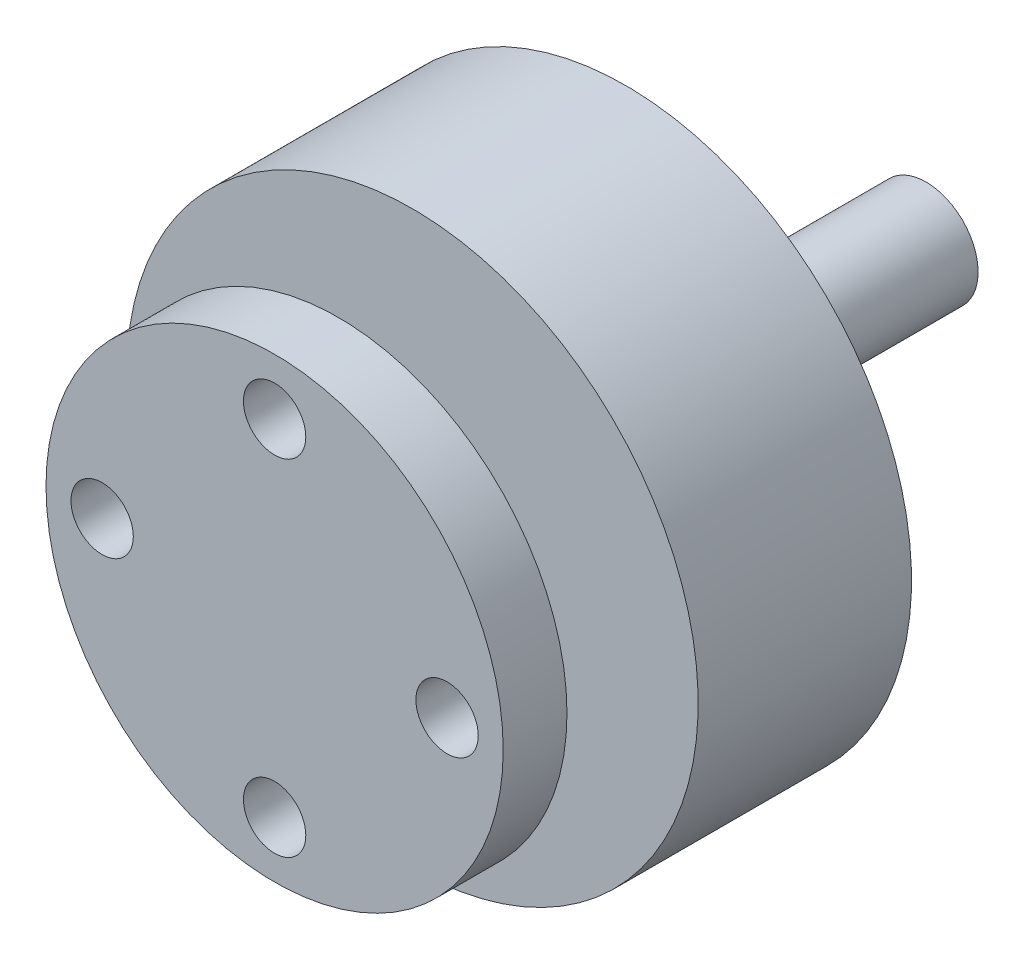
ISO-10303-21;
HEADER;
FILE_DESCRIPTION(('STEP AP214'),'2;1');
FILE_NAME('part.step','',(''),(''),'','','');
FILE_SCHEMA(('AUTOMOTIVE_DESIGN { 1 0 10303 214 1 1 1 1 }'));
ENDSEC;
DATA;
#1=APPLICATION_CONTEXT('core data for automotive mechanical design processes');
#2=APPLICATION_PROTOCOL_DEFINITION('international standard','automotive_design',2000,#1);
#3=PRODUCT_CONTEXT('',#1,'mechanical');
#4=PRODUCT('Part','Part','',(#3));
#5=PRODUCT_RELATED_PRODUCT_CATEGORY('part','',(#4));
#6=PRODUCT_DEFINITION_FORMATION('','',#4);
#7=PRODUCT_DEFINITION_CONTEXT('part definition',#1,'design');
#8=PRODUCT_DEFINITION('design','',#6,#7);
#9=PRODUCT_DEFINITION_SHAPE('','',#8);
#10=(LENGTH_UNIT() NAMED_UNIT(*) SI_UNIT(.MILLI.,.METRE.));
#11=(NAMED_UNIT(*) PLANE_ANGLE_UNIT() SI_UNIT($,.RADIAN.));
#12=(NAMED_UNIT(*) SI_UNIT($,.STERADIAN.) SOLID_ANGLE_UNIT());
#13=UNCERTAINTY_MEASURE_WITH_UNIT(LENGTH_MEASURE(1.E-05),#10,'distance_accuracy_value','');
#14=(GEOMETRIC_REPRESENTATION_CONTEXT(3) GLOBAL_UNCERTAINTY_ASSIGNED_CONTEXT((#13)) GLOBAL_UNIT_ASSIGNED_CONTEXT((#10,
#11,#12)) REPRESENTATION_CONTEXT('',''));
#15=CARTESIAN_POINT('',(0.,0.,0.));
#16=DIRECTION('',(0.,0.,1.));
#17=DIRECTION('',(1.,0.,0.));
#18=AXIS2_PLACEMENT_3D('',#15,#16,#17);
#19=CARTESIAN_POINT('',(0.,0.,0.));
#20=DIRECTION('',(0.,0.,-1.));
#21=DIRECTION('',(-1.,0.,0.));
#22=AXIS2_PLACEMENT_3D('',#19,#20,#21);
#23=PLANE('',#22);
#24=CARTESIAN_POINT('',(8.2988893822453,0.,0.));
#25=DIRECTION('',(0.,0.,1.));
#26=DIRECTION('',(1.,0.,0.));
#27=AXIS2_PLACEMENT_3D('',#24,#25,#26);
#28=CIRCLE('',#27,1.5);
#29=CARTESIAN_POINT('',(9.7988893822453,0.,0.));
#30=VERTEX_POINT('',#29);
#31=EDGE_CURVE('E62',#30,#30,#28,.T.);
#32=ORIENTED_EDGE('',*,*,#31,.F.);
#33=EDGE_LOOP('',(#32));
#34=FACE_BOUND('',#33,.T.);
#35=CARTESIAN_POINT('',(0.,-8.2988893822453,0.));
#36=DIRECTION('',(0.,0.,1.));
#37=DIRECTION('',(1.,0.,0.));
#38=AXIS2_PLACEMENT_3D('',#35,#36,#37);
#39=CIRCLE('',#38,1.5);
#40=CARTESIAN_POINT('',(1.49999999999997,-8.2988893822453,0.));
#41=VERTEX_POINT('',#40);
#42=EDGE_CURVE('E169',#41,#41,#39,.T.);
#43=ORIENTED_EDGE('',*,*,#42,.F.);
#44=EDGE_LOOP('',(#43));
#45=FACE_BOUND('',#44,.T.);
#46=CARTESIAN_POINT('',(-8.2988893822453,0.,0.));
#47=DIRECTION('',(0.,0.,1.));
#48=DIRECTION('',(1.,0.,0.));
#49=AXIS2_PLACEMENT_3D('',#46,#47,#48);
#50=CIRCLE('',#49,1.5);
#51=CARTESIAN_POINT('',(-6.7988893822453,0.,0.));
#52=VERTEX_POINT('',#51);
#53=EDGE_CURVE('E173',#52,#52,#50,.T.);
#54=ORIENTED_EDGE('',*,*,#53,.F.);
#55=EDGE_LOOP('',(#54));
#56=FACE_BOUND('',#55,.T.);
#57=CARTESIAN_POINT('',(0.,8.2988893822453,0.));
#58=DIRECTION('',(0.,0.,1.));
#59=DIRECTION('',(1.,0.,0.));
#60=AXIS2_PLACEMENT_3D('',#57,#58,#59);
#61=CIRCLE('',#60,1.5);
#62=CARTESIAN_POINT('',(1.50000000000009,8.2988893822453,0.));
#63=VERTEX_POINT('',#62);
#64=EDGE_CURVE('E86',#63,#63,#61,.T.);
#65=ORIENTED_EDGE('',*,*,#64,.F.);
#66=EDGE_LOOP('',(#65));
#67=FACE_BOUND('',#66,.T.);
#68=CARTESIAN_POINT('',(0.,0.,0.));
#69=DIRECTION('',(0.,0.,-1.));
#70=DIRECTION('',(-1.,0.,0.));
#71=AXIS2_PLACEMENT_3D('',#68,#69,#70);
#72=CIRCLE('',#71,11.);
#73=CARTESIAN_POINT('',(-11.,0.,0.));
#74=VERTEX_POINT('',#73);
#75=EDGE_CURVE('E10',#74,#74,#72,.T.);
#76=ORIENTED_EDGE('',*,*,#75,.F.);
#77=EDGE_LOOP('',(#76));
#78=FACE_BOUND('',#77,.T.);
#79=ADVANCED_FACE('F39',(#34,#45,#56,#67,#78),#23,.F.);
#80=CARTESIAN_POINT('',(0.,0.,-31.35));
#81=DIRECTION('',(0.,0.,-1.));
#82=DIRECTION('',(-1.,0.,0.));
#83=AXIS2_PLACEMENT_3D('',#80,#81,#82);
#84=CYLINDRICAL_SURFACE('',#83,11.);
#85=CARTESIAN_POINT('',(0.,0.,-3.06822982991311));
#86=DIRECTION('',(0.,0.,-1.));
#87=DIRECTION('',(-1.,0.,0.));
#88=AXIS2_PLACEMENT_3D('',#85,#86,#87);
#89=CIRCLE('',#88,11.);
#90=CARTESIAN_POINT('',(-11.,0.,-3.06822982991311));
#91=VERTEX_POINT('',#90);
#92=EDGE_CURVE('E47',#91,#91,#89,.T.);
#93=ORIENTED_EDGE('',*,*,#92,.F.);
#94=EDGE_LOOP('',(#93));
#95=FACE_BOUND('',#94,.T.);
#96=ORIENTED_EDGE('',*,*,#75,.T.);
#97=EDGE_LOOP('',(#96));
#98=FACE_BOUND('',#97,.T.);
#99=ADVANCED_FACE('F112',(#95,#98),#84,.T.);
#100=CARTESIAN_POINT('',(11.,0.,-3.0682298299131));
#101=DIRECTION('',(0.,0.,1.));
#102=DIRECTION('',(1.,0.,0.));
#103=AXIS2_PLACEMENT_3D('',#100,#101,#102);
#104=PLANE('',#103);
#105=CARTESIAN_POINT('',(8.2988893822453,0.,-3.0682298299131));
#106=DIRECTION('',(0.,0.,1.));
#107=DIRECTION('',(1.,0.,0.));
#108=AXIS2_PLACEMENT_3D('',#105,#106,#107);
#109=CIRCLE('',#108,1.5);
#110=CARTESIAN_POINT('',(9.7988893822453,0.,-3.0682298299131));
#111=VERTEX_POINT('',#110);
#112=EDGE_CURVE('E42',#111,#111,#109,.T.);
#113=ORIENTED_EDGE('',*,*,#112,.T.);
#114=EDGE_LOOP('',(#113));
#115=FACE_BOUND('',#114,.T.);
#116=CARTESIAN_POINT('',(0.,-8.2988893822453,-3.0682298299131));
#117=DIRECTION('',(0.,0.,1.));
#118=DIRECTION('',(1.,0.,0.));
#119=AXIS2_PLACEMENT_3D('',#116,#117,#118);
#120=CIRCLE('',#119,1.5);
#121=CARTESIAN_POINT('',(1.49999999999997,-8.2988893822453,-3.0682298299131));
#122=VERTEX_POINT('',#121);
#123=EDGE_CURVE('E65',#122,#122,#120,.T.);
#124=ORIENTED_EDGE('',*,*,#123,.T.);
#125=EDGE_LOOP('',(#124));
#126=FACE_BOUND('',#125,.T.);
#127=CARTESIAN_POINT('',(-8.2988893822453,0.,-3.06822982991311));
#128=DIRECTION('',(0.,0.,1.));
#129=DIRECTION('',(1.,0.,0.));
#130=AXIS2_PLACEMENT_3D('',#127,#128,#129);
#131=CIRCLE('',#130,1.5);
#132=CARTESIAN_POINT('',(-6.7988893822453,0.,-3.06822982991311));
#133=VERTEX_POINT('',#132);
#134=EDGE_CURVE('E61',#133,#133,#131,.T.);
#135=ORIENTED_EDGE('',*,*,#134,.T.);
#136=EDGE_LOOP('',(#135));
#137=FACE_BOUND('',#136,.T.);
#138=CARTESIAN_POINT('',(0.,8.2988893822453,-3.0682298299131));
#139=DIRECTION('',(0.,0.,1.));
#140=DIRECTION('',(1.,0.,0.));
#141=AXIS2_PLACEMENT_3D('',#138,#139,#140);
#142=CIRCLE('',#141,1.5);
#143=CARTESIAN_POINT('',(1.50000000000009,8.2988893822453,-3.0682298299131));
#144=VERTEX_POINT('',#143);
#145=EDGE_CURVE('E57',#144,#144,#142,.T.);
#146=ORIENTED_EDGE('',*,*,#145,.T.);
#147=EDGE_LOOP('',(#146));
#148=FACE_BOUND('',#147,.T.);
#149=CARTESIAN_POINT('',(0.,0.,-3.0682298299131));
#150=DIRECTION('',(0.,0.,-1.));
#151=DIRECTION('',(-1.,0.,0.));
#152=AXIS2_PLACEMENT_3D('',#149,#150,#151);
#153=CIRCLE('',#152,3.7385620799455);
#154=CARTESIAN_POINT('',(-3.73856207994549,0.,-3.0682298299131));
#155=VERTEX_POINT('',#154);
#156=EDGE_CURVE('E53',#155,#155,#153,.T.);
#157=ORIENTED_EDGE('',*,*,#156,.F.);
#158=EDGE_LOOP('',(#157));
#159=FACE_BOUND('',#158,.T.);
#160=ORIENTED_EDGE('',*,*,#92,.T.);
#161=EDGE_LOOP('',(#160));
#162=FACE_BOUND('',#161,.T.);
#163=ADVANCED_FACE('F109',(#115,#126,#137,#148,#159,#162),#104,.F.);
#164=CARTESIAN_POINT('',(0.,0.,-31.35));
#165=DIRECTION('',(0.,0.,-1.));
#166=DIRECTION('',(-1.,0.,0.));
#167=AXIS2_PLACEMENT_3D('',#164,#165,#166);
#168=CYLINDRICAL_SURFACE('',#167,3.73856207994549);
#169=CARTESIAN_POINT('',(0.,0.,-6.6312906854376));
#170=DIRECTION('',(0.,0.,-1.));
#171=DIRECTION('',(-1.,0.,0.));
#172=AXIS2_PLACEMENT_3D('',#169,#170,#171);
#173=CIRCLE('',#172,3.73856207994549);
#174=CARTESIAN_POINT('',(-3.73856207994549,0.,-6.63129068543761));
#175=VERTEX_POINT('',#174);
#176=EDGE_CURVE('E100',#175,#175,#173,.T.);
#177=ORIENTED_EDGE('',*,*,#176,.F.);
#178=EDGE_LOOP('',(#177));
#179=FACE_BOUND('',#178,.T.);
#180=ORIENTED_EDGE('',*,*,#156,.T.);
#181=EDGE_LOOP('',(#180));
#182=FACE_BOUND('',#181,.T.);
#183=ADVANCED_FACE('F107',(#179,#182),#168,.T.);
#184=CARTESIAN_POINT('',(3.7385620799455,0.,-6.63129068543761));
#185=DIRECTION('',(0.,0.,-1.));
#186=DIRECTION('',(-1.,0.,0.));
#187=AXIS2_PLACEMENT_3D('',#184,#185,#186);
#188=PLANE('',#187);
#189=CARTESIAN_POINT('',(0.,0.,-6.63129068543761));
#190=DIRECTION('',(0.,0.,-1.));
#191=DIRECTION('',(-1.,0.,0.));
#192=AXIS2_PLACEMENT_3D('',#189,#190,#191);
#193=CIRCLE('',#192,13.75);
#194=CARTESIAN_POINT('',(-13.75,0.,-6.63129068543761));
#195=VERTEX_POINT('',#194);
#196=EDGE_CURVE('E96',#195,#195,#193,.T.);
#197=ORIENTED_EDGE('',*,*,#196,.F.);
#198=EDGE_LOOP('',(#197));
#199=FACE_BOUND('',#198,.T.);
#200=ORIENTED_EDGE('',*,*,#176,.T.);
#201=EDGE_LOOP('',(#200));
#202=FACE_BOUND('',#201,.T.);
#203=ADVANCED_FACE('F124',(#199,#202),#188,.F.);
#204=CARTESIAN_POINT('',(0.,0.,-31.35));
#205=DIRECTION('',(0.,0.,-1.));
#206=DIRECTION('',(-1.,0.,0.));
#207=AXIS2_PLACEMENT_3D('',#204,#205,#206);
#208=CYLINDRICAL_SURFACE('',#207,13.75);
#209=CARTESIAN_POINT('',(0.,0.,-16.8962993406391));
#210=DIRECTION('',(0.,0.,-1.));
#211=DIRECTION('',(-1.,0.,0.));
#212=AXIS2_PLACEMENT_3D('',#209,#210,#211);
#213=CIRCLE('',#212,13.75);
#214=CARTESIAN_POINT('',(-13.75,0.,-16.8962993406391));
#215=VERTEX_POINT('',#214);
#216=EDGE_CURVE('E92',#215,#215,#213,.T.);
#217=ORIENTED_EDGE('',*,*,#216,.F.);
#218=EDGE_LOOP('',(#217));
#219=FACE_BOUND('',#218,.T.);
#220=ORIENTED_EDGE('',*,*,#196,.T.);
#221=EDGE_LOOP('',(#220));
#222=FACE_BOUND('',#221,.T.);
#223=ADVANCED_FACE('F128',(#219,#222),#208,.T.);
#224=CARTESIAN_POINT('',(0.,0.,-16.8962993406391));
#225=DIRECTION('',(0.,0.,1.));
#226=DIRECTION('',(1.,0.,0.));
#227=AXIS2_PLACEMENT_3D('',#224,#225,#226);
#228=CONICAL_SURFACE('',#227,13.75,1.17848113510543);
#229=CARTESIAN_POINT('',(0.,0.,-19.35));
#230=DIRECTION('',(0.,0.,-1.));
#231=DIRECTION('',(-1.,0.,0.));
#232=AXIS2_PLACEMENT_3D('',#229,#230,#231);
#233=CIRCLE('',#232,7.81980457823857);
#234=CARTESIAN_POINT('',(-7.81980457823857,0.,-19.35));
#235=VERTEX_POINT('',#234);
#236=EDGE_CURVE('E83',#235,#235,#233,.T.);
#237=ORIENTED_EDGE('',*,*,#236,.F.);
#238=EDGE_LOOP('',(#237));
#239=FACE_BOUND('',#238,.T.);
#240=ORIENTED_EDGE('',*,*,#216,.T.);
#241=EDGE_LOOP('',(#240));
#242=FACE_BOUND('',#241,.T.);
#243=ADVANCED_FACE('F132',(#239,#242),#228,.T.);
#244=CARTESIAN_POINT('',(7.81980457823857,0.,-19.35));
#245=DIRECTION('',(0.,0.,1.));
#246=DIRECTION('',(1.,0.,0.));
#247=AXIS2_PLACEMENT_3D('',#244,#245,#246);
#248=PLANE('',#247);
#249=CARTESIAN_POINT('',(0.,0.,-19.35));
#250=DIRECTION('',(0.,0.,-1.));
#251=DIRECTION('',(-1.,0.,0.));
#252=AXIS2_PLACEMENT_3D('',#249,#250,#251);
#253=CIRCLE('',#252,2.5);
#254=CARTESIAN_POINT('',(-2.49999999999999,0.,-19.35));
#255=VERTEX_POINT('',#254);
#256=EDGE_CURVE('E77',#255,#255,#253,.T.);
#257=ORIENTED_EDGE('',*,*,#256,.F.);
#258=EDGE_LOOP('',(#257));
#259=FACE_BOUND('',#258,.T.);
#260=ORIENTED_EDGE('',*,*,#236,.T.);
#261=EDGE_LOOP('',(#260));
#262=FACE_BOUND('',#261,.T.);
#263=ADVANCED_FACE('F136',(#259,#262),#248,.F.);
#264=CARTESIAN_POINT('',(0.,0.,-31.35));
#265=DIRECTION('',(0.,0.,-1.));
#266=DIRECTION('',(-1.,0.,0.));
#267=AXIS2_PLACEMENT_3D('',#264,#265,#266);
#268=CYLINDRICAL_SURFACE('',#267,2.49999999999999);
#269=CARTESIAN_POINT('',(0.,0.,-31.35));
#270=DIRECTION('',(0.,0.,-1.));
#271=DIRECTION('',(-1.,0.,0.));
#272=AXIS2_PLACEMENT_3D('',#269,#270,#271);
#273=CIRCLE('',#272,2.49999999999999);
#274=CARTESIAN_POINT('',(-2.49999999999999,0.,-31.35));
#275=VERTEX_POINT('',#274);
#276=EDGE_CURVE('E72',#275,#275,#273,.T.);
#277=ORIENTED_EDGE('',*,*,#276,.F.);
#278=EDGE_LOOP('',(#277));
#279=FACE_BOUND('',#278,.T.);
#280=ORIENTED_EDGE('',*,*,#256,.T.);
#281=EDGE_LOOP('',(#280));
#282=FACE_BOUND('',#281,.T.);
#283=ADVANCED_FACE('F140',(#279,#282),#268,.T.);
#284=CARTESIAN_POINT('',(2.5,0.,-31.35));
#285=DIRECTION('',(0.,0.,1.));
#286=DIRECTION('',(1.,0.,0.));
#287=AXIS2_PLACEMENT_3D('',#284,#285,#286);
#288=PLANE('',#287);
#289=ORIENTED_EDGE('',*,*,#276,.T.);
#290=EDGE_LOOP('',(#289));
#291=FACE_BOUND('',#290,.T.);
#292=ADVANCED_FACE('F144',(#291),#288,.F.);
#293=CARTESIAN_POINT('',(0.,8.2988893822453,-5.));
#294=DIRECTION('',(0.,0.,1.));
#295=DIRECTION('',(1.,0.,0.));
#296=AXIS2_PLACEMENT_3D('',#293,#294,#295);
#297=CYLINDRICAL_SURFACE('',#296,1.5);
#298=ORIENTED_EDGE('',*,*,#64,.T.);
#299=EDGE_LOOP('',(#298));
#300=FACE_BOUND('',#299,.T.);
#301=ORIENTED_EDGE('',*,*,#145,.F.);
#302=EDGE_LOOP('',(#301));
#303=FACE_BOUND('',#302,.T.);
#304=ADVANCED_FACE('F148',(#300,#303),#297,.F.);
#305=CARTESIAN_POINT('',(-8.2988893822453,0.,-5.));
#306=DIRECTION('',(0.,0.,1.));
#307=DIRECTION('',(1.,0.,0.));
#308=AXIS2_PLACEMENT_3D('',#305,#306,#307);
#309=CYLINDRICAL_SURFACE('',#308,1.5);
#310=ORIENTED_EDGE('',*,*,#53,.T.);
#311=EDGE_LOOP('',(#310));
#312=FACE_BOUND('',#311,.T.);
#313=ORIENTED_EDGE('',*,*,#134,.F.);
#314=EDGE_LOOP('',(#313));
#315=FACE_BOUND('',#314,.T.);
#316=ADVANCED_FACE('F151',(#312,#315),#309,.F.);
#317=CARTESIAN_POINT('',(0.,-8.2988893822453,-5.));
#318=DIRECTION('',(0.,0.,1.));
#319=DIRECTION('',(1.,0.,0.));
#320=AXIS2_PLACEMENT_3D('',#317,#318,#319);
#321=CYLINDRICAL_SURFACE('',#320,1.5);
#322=ORIENTED_EDGE('',*,*,#42,.T.);
#323=EDGE_LOOP('',(#322));
#324=FACE_BOUND('',#323,.T.);
#325=ORIENTED_EDGE('',*,*,#123,.F.);
#326=EDGE_LOOP('',(#325));
#327=FACE_BOUND('',#326,.T.);
#328=ADVANCED_FACE('F155',(#324,#327),#321,.F.);
#329=CARTESIAN_POINT('',(8.2988893822453,0.,-5.));
#330=DIRECTION('',(0.,0.,1.));
#331=DIRECTION('',(1.,0.,0.));
#332=AXIS2_PLACEMENT_3D('',#329,#330,#331);
#333=CYLINDRICAL_SURFACE('',#332,1.5);
#334=ORIENTED_EDGE('',*,*,#31,.T.);
#335=EDGE_LOOP('',(#334));
#336=FACE_BOUND('',#335,.T.);
#337=ORIENTED_EDGE('',*,*,#112,.F.);
#338=EDGE_LOOP('',(#337));
#339=FACE_BOUND('',#338,.T.);
#340=ADVANCED_FACE('F159',(#336,#339),#333,.F.);
#341=CLOSED_SHELL('',(#79,#99,#163,#183,#203,#223,#243,#263,#283,#292,#304,#316,#328,#340));
#342=MANIFOLD_SOLID_BREP('B2',#341);
#343=ADVANCED_BREP_SHAPE_REPRESENTATION('',(#18,#342),#14);
#344=SHAPE_DEFINITION_REPRESENTATION(#9,#343);
ENDSEC;
END-ISO-10303-21;
